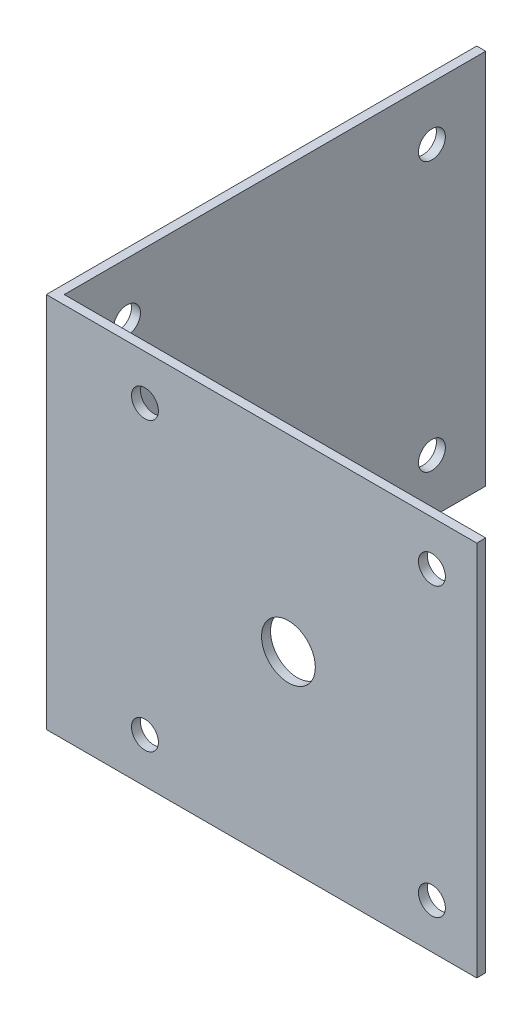
ISO-10303-21;
HEADER;
FILE_DESCRIPTION(('STEP AP214'),'2;1');
FILE_NAME('part.step','',(''),(''),'','','');
FILE_SCHEMA(('AUTOMOTIVE_DESIGN { 1 0 10303 214 1 1 1 1 }'));
ENDSEC;
DATA;
#1=APPLICATION_CONTEXT('core data for automotive mechanical design processes');
#2=APPLICATION_PROTOCOL_DEFINITION('international standard','automotive_design',2000,#1);
#3=PRODUCT_CONTEXT('',#1,'mechanical');
#4=PRODUCT('Part','Part','',(#3));
#5=PRODUCT_RELATED_PRODUCT_CATEGORY('part','',(#4));
#6=PRODUCT_DEFINITION_FORMATION('','',#4);
#7=PRODUCT_DEFINITION_CONTEXT('part definition',#1,'design');
#8=PRODUCT_DEFINITION('design','',#6,#7);
#9=PRODUCT_DEFINITION_SHAPE('','',#8);
#10=(LENGTH_UNIT() NAMED_UNIT(*) SI_UNIT(.MILLI.,.METRE.));
#11=(NAMED_UNIT(*) PLANE_ANGLE_UNIT() SI_UNIT($,.RADIAN.));
#12=(NAMED_UNIT(*) SI_UNIT($,.STERADIAN.) SOLID_ANGLE_UNIT());
#13=UNCERTAINTY_MEASURE_WITH_UNIT(LENGTH_MEASURE(1.E-05),#10,'distance_accuracy_value','');
#14=(GEOMETRIC_REPRESENTATION_CONTEXT(3) GLOBAL_UNCERTAINTY_ASSIGNED_CONTEXT((#13)) GLOBAL_UNIT_ASSIGNED_CONTEXT((#10,
#11,#12)) REPRESENTATION_CONTEXT('',''));
#15=CARTESIAN_POINT('',(0.,0.,0.));
#16=DIRECTION('',(0.,0.,1.));
#17=DIRECTION('',(1.,0.,0.));
#18=AXIS2_PLACEMENT_3D('',#15,#16,#17);
#19=CARTESIAN_POINT('',(0.,42.,0.));
#20=DIRECTION('',(0.,0.,-1.));
#21=DIRECTION('',(-1.,0.,0.));
#22=AXIS2_PLACEMENT_3D('',#19,#20,#21);
#23=PLANE('',#22);
#24=CARTESIAN_POINT('',(43.,37.,0.));
#25=DIRECTION('',(0.,0.,1.));
#26=DIRECTION('',(1.,0.,0.));
#27=AXIS2_PLACEMENT_3D('',#24,#25,#26);
#28=CIRCLE('',#27,1.5);
#29=CARTESIAN_POINT('',(44.5,37.,0.));
#30=VERTEX_POINT('',#29);
#31=EDGE_CURVE('E144',#30,#30,#28,.T.);
#32=ORIENTED_EDGE('',*,*,#31,.F.);
#33=EDGE_LOOP('',(#32));
#34=FACE_BOUND('',#33,.T.);
#35=CARTESIAN_POINT('',(43.,5.,0.));
#36=DIRECTION('',(0.,0.,1.));
#37=DIRECTION('',(1.,0.,0.));
#38=AXIS2_PLACEMENT_3D('',#35,#36,#37);
#39=CIRCLE('',#38,1.5);
#40=CARTESIAN_POINT('',(44.5,5.,0.));
#41=VERTEX_POINT('',#40);
#42=EDGE_CURVE('E196',#41,#41,#39,.T.);
#43=ORIENTED_EDGE('',*,*,#42,.F.);
#44=EDGE_LOOP('',(#43));
#45=FACE_BOUND('',#44,.T.);
#46=CARTESIAN_POINT('',(11.,5.,0.));
#47=DIRECTION('',(0.,0.,1.));
#48=DIRECTION('',(1.,0.,0.));
#49=AXIS2_PLACEMENT_3D('',#46,#47,#48);
#50=CIRCLE('',#49,1.5);
#51=CARTESIAN_POINT('',(12.5,5.,0.));
#52=VERTEX_POINT('',#51);
#53=EDGE_CURVE('E200',#52,#52,#50,.T.);
#54=ORIENTED_EDGE('',*,*,#53,.F.);
#55=EDGE_LOOP('',(#54));
#56=FACE_BOUND('',#55,.T.);
#57=CARTESIAN_POINT('',(27.,21.,0.));
#58=DIRECTION('',(0.,0.,1.));
#59=DIRECTION('',(1.,0.,0.));
#60=AXIS2_PLACEMENT_3D('',#57,#58,#59);
#61=CIRCLE('',#60,3.);
#62=CARTESIAN_POINT('',(30.,21.,0.));
#63=VERTEX_POINT('',#62);
#64=EDGE_CURVE('E159',#63,#63,#61,.T.);
#65=ORIENTED_EDGE('',*,*,#64,.F.);
#66=EDGE_LOOP('',(#65));
#67=FACE_BOUND('',#66,.T.);
#68=CARTESIAN_POINT('',(11.,37.,0.));
#69=DIRECTION('',(0.,0.,1.));
#70=DIRECTION('',(1.,0.,0.));
#71=AXIS2_PLACEMENT_3D('',#68,#69,#70);
#72=CIRCLE('',#71,1.5);
#73=CARTESIAN_POINT('',(12.5,37.,0.));
#74=VERTEX_POINT('',#73);
#75=EDGE_CURVE('E139',#74,#74,#72,.T.);
#76=ORIENTED_EDGE('',*,*,#75,.F.);
#77=EDGE_LOOP('',(#76));
#78=FACE_BOUND('',#77,.T.);
#79=DIRECTION('',(1.,0.,0.));
#80=VECTOR('',#79,1.);
#81=CARTESIAN_POINT('',(0.,0.,0.));
#82=LINE('',#81,#80);
#83=CARTESIAN_POINT('',(0.,0.,0.));
#84=VERTEX_POINT('',#83);
#85=CARTESIAN_POINT('',(48.,0.,0.));
#86=VERTEX_POINT('',#85);
#87=EDGE_CURVE('E120',#84,#86,#82,.T.);
#88=ORIENTED_EDGE('',*,*,#87,.T.);
#89=DIRECTION('',(0.,-1.,0.));
#90=VECTOR('',#89,1.);
#91=CARTESIAN_POINT('',(48.,42.,0.));
#92=LINE('',#91,#90);
#93=CARTESIAN_POINT('',(48.,42.,0.));
#94=VERTEX_POINT('',#93);
#95=EDGE_CURVE('E11',#94,#86,#92,.T.);
#96=ORIENTED_EDGE('',*,*,#95,.F.);
#97=DIRECTION('',(1.,0.,0.));
#98=VECTOR('',#97,1.);
#99=CARTESIAN_POINT('',(0.,42.,0.));
#100=LINE('',#99,#98);
#101=CARTESIAN_POINT('',(0.,42.,0.));
#102=VERTEX_POINT('',#101);
#103=EDGE_CURVE('E131',#102,#94,#100,.T.);
#104=ORIENTED_EDGE('',*,*,#103,.F.);
#105=DIRECTION('',(0.,-1.,0.));
#106=VECTOR('',#105,1.);
#107=CARTESIAN_POINT('',(0.,42.,0.));
#108=LINE('',#107,#106);
#109=EDGE_CURVE('E116',#102,#84,#108,.T.);
#110=ORIENTED_EDGE('',*,*,#109,.T.);
#111=EDGE_LOOP('',(#88,#96,#104,#110));
#112=FACE_BOUND('',#111,.T.);
#113=ADVANCED_FACE('F34',(#34,#45,#56,#67,#78,#112),#23,.F.);
#114=CARTESIAN_POINT('',(48.,42.,0.));
#115=DIRECTION('',(-1.,0.,0.));
#116=DIRECTION('',(0.,0.,1.));
#117=AXIS2_PLACEMENT_3D('',#114,#115,#116);
#118=PLANE('',#117);
#119=DIRECTION('',(0.,0.,-1.));
#120=VECTOR('',#119,1.);
#121=CARTESIAN_POINT('',(48.,0.,0.));
#122=LINE('',#121,#120);
#123=CARTESIAN_POINT('',(48.,0.,-1.));
#124=VERTEX_POINT('',#123);
#125=EDGE_CURVE('E123',#86,#124,#122,.T.);
#126=ORIENTED_EDGE('',*,*,#125,.T.);
#127=DIRECTION('',(0.,-1.,0.));
#128=VECTOR('',#127,1.);
#129=CARTESIAN_POINT('',(48.,42.,-1.));
#130=LINE('',#129,#128);
#131=CARTESIAN_POINT('',(48.,42.,-1.));
#132=VERTEX_POINT('',#131);
#133=EDGE_CURVE('E43',#132,#124,#130,.T.);
#134=ORIENTED_EDGE('',*,*,#133,.F.);
#135=DIRECTION('',(0.,0.,-1.));
#136=VECTOR('',#135,1.);
#137=CARTESIAN_POINT('',(48.,42.,0.));
#138=LINE('',#137,#136);
#139=EDGE_CURVE('E89',#94,#132,#138,.T.);
#140=ORIENTED_EDGE('',*,*,#139,.F.);
#141=ORIENTED_EDGE('',*,*,#95,.T.);
#142=EDGE_LOOP('',(#126,#134,#140,#141));
#143=FACE_BOUND('',#142,.T.);
#144=ADVANCED_FACE('F164',(#143),#118,.F.);
#145=CARTESIAN_POINT('',(1.00000000000001,42.,-1.));
#146=DIRECTION('',(0.,0.,1.));
#147=DIRECTION('',(1.,0.,0.));
#148=AXIS2_PLACEMENT_3D('',#145,#146,#147);
#149=PLANE('',#148);
#150=CARTESIAN_POINT('',(43.,37.,-1.00000000000001));
#151=DIRECTION('',(0.,0.,1.));
#152=DIRECTION('',(1.,0.,0.));
#153=AXIS2_PLACEMENT_3D('',#150,#151,#152);
#154=CIRCLE('',#153,1.5);
#155=CARTESIAN_POINT('',(44.5,37.,-1.00000000000001));
#156=VERTEX_POINT('',#155);
#157=EDGE_CURVE('E37',#156,#156,#154,.T.);
#158=ORIENTED_EDGE('',*,*,#157,.T.);
#159=EDGE_LOOP('',(#158));
#160=FACE_BOUND('',#159,.T.);
#161=CARTESIAN_POINT('',(43.,5.,-1.00000000000001));
#162=DIRECTION('',(0.,0.,1.));
#163=DIRECTION('',(1.,0.,0.));
#164=AXIS2_PLACEMENT_3D('',#161,#162,#163);
#165=CIRCLE('',#164,1.5);
#166=CARTESIAN_POINT('',(44.5,5.,-1.00000000000001));
#167=VERTEX_POINT('',#166);
#168=EDGE_CURVE('E146',#167,#167,#165,.T.);
#169=ORIENTED_EDGE('',*,*,#168,.T.);
#170=EDGE_LOOP('',(#169));
#171=FACE_BOUND('',#170,.T.);
#172=CARTESIAN_POINT('',(11.,5.,-1.00000000000001));
#173=DIRECTION('',(0.,0.,1.));
#174=DIRECTION('',(1.,0.,0.));
#175=AXIS2_PLACEMENT_3D('',#172,#173,#174);
#176=CIRCLE('',#175,1.5);
#177=CARTESIAN_POINT('',(12.5,5.,-1.00000000000001));
#178=VERTEX_POINT('',#177);
#179=EDGE_CURVE('E143',#178,#178,#176,.T.);
#180=ORIENTED_EDGE('',*,*,#179,.T.);
#181=EDGE_LOOP('',(#180));
#182=FACE_BOUND('',#181,.T.);
#183=CARTESIAN_POINT('',(27.,21.,-1.00000000000001));
#184=DIRECTION('',(0.,0.,1.));
#185=DIRECTION('',(1.,0.,0.));
#186=AXIS2_PLACEMENT_3D('',#183,#184,#185);
#187=CIRCLE('',#186,3.);
#188=CARTESIAN_POINT('',(30.,21.,-1.00000000000001));
#189=VERTEX_POINT('',#188);
#190=EDGE_CURVE('E140',#189,#189,#187,.T.);
#191=ORIENTED_EDGE('',*,*,#190,.T.);
#192=EDGE_LOOP('',(#191));
#193=FACE_BOUND('',#192,.T.);
#194=CARTESIAN_POINT('',(11.,37.,-1.00000000000001));
#195=DIRECTION('',(0.,0.,1.));
#196=DIRECTION('',(1.,0.,0.));
#197=AXIS2_PLACEMENT_3D('',#194,#195,#196);
#198=CIRCLE('',#197,1.5);
#199=CARTESIAN_POINT('',(12.5,37.,-1.00000000000001));
#200=VERTEX_POINT('',#199);
#201=EDGE_CURVE('E124',#200,#200,#198,.T.);
#202=ORIENTED_EDGE('',*,*,#201,.T.);
#203=EDGE_LOOP('',(#202));
#204=FACE_BOUND('',#203,.T.);
#205=DIRECTION('',(-1.,0.,0.));
#206=VECTOR('',#205,1.);
#207=CARTESIAN_POINT('',(1.00000000000001,0.,-1.));
#208=LINE('',#207,#206);
#209=CARTESIAN_POINT('',(1.00000000000001,0.,-1.));
#210=VERTEX_POINT('',#209);
#211=EDGE_CURVE('E126',#124,#210,#208,.T.);
#212=ORIENTED_EDGE('',*,*,#211,.T.);
#213=DIRECTION('',(0.,-1.,0.));
#214=VECTOR('',#213,1.);
#215=CARTESIAN_POINT('',(1.00000000000001,42.,-1.));
#216=LINE('',#215,#214);
#217=CARTESIAN_POINT('',(1.00000000000001,42.,-1.));
#218=VERTEX_POINT('',#217);
#219=EDGE_CURVE('E111',#218,#210,#216,.T.);
#220=ORIENTED_EDGE('',*,*,#219,.F.);
#221=DIRECTION('',(-1.,0.,0.));
#222=VECTOR('',#221,1.);
#223=CARTESIAN_POINT('',(1.00000000000001,42.,-1.));
#224=LINE('',#223,#222);
#225=EDGE_CURVE('E102',#132,#218,#224,.T.);
#226=ORIENTED_EDGE('',*,*,#225,.F.);
#227=ORIENTED_EDGE('',*,*,#133,.T.);
#228=EDGE_LOOP('',(#212,#220,#226,#227));
#229=FACE_BOUND('',#228,.T.);
#230=ADVANCED_FACE('F167',(#160,#171,#182,#193,#204,#229),#149,.F.);
#231=CARTESIAN_POINT('',(1.,42.,-48.));
#232=DIRECTION('',(-1.,0.,0.));
#233=DIRECTION('',(0.,0.,1.));
#234=AXIS2_PLACEMENT_3D('',#231,#232,#233);
#235=PLANE('',#234);
#236=CARTESIAN_POINT('',(1.00000000000001,6.,-42.));
#237=DIRECTION('',(-1.,0.,0.));
#238=DIRECTION('',(0.,0.,1.));
#239=AXIS2_PLACEMENT_3D('',#236,#237,#238);
#240=CIRCLE('',#239,1.5);
#241=CARTESIAN_POINT('',(1.00000000000001,6.,-40.5));
#242=VERTEX_POINT('',#241);
#243=EDGE_CURVE('E212',#242,#242,#240,.F.);
#244=ORIENTED_EDGE('',*,*,#243,.F.);
#245=EDGE_LOOP('',(#244));
#246=FACE_BOUND('',#245,.T.);
#247=CARTESIAN_POINT('',(1.00000000000001,5.99999999999999,-8.00000000000001));
#248=DIRECTION('',(-1.,0.,0.));
#249=DIRECTION('',(0.,0.,1.));
#250=AXIS2_PLACEMENT_3D('',#247,#248,#249);
#251=CIRCLE('',#250,1.5);
#252=CARTESIAN_POINT('',(1.00000000000001,5.99999999999999,-6.50000000000001));
#253=VERTEX_POINT('',#252);
#254=EDGE_CURVE('E332',#253,#253,#251,.F.);
#255=ORIENTED_EDGE('',*,*,#254,.F.);
#256=EDGE_LOOP('',(#255));
#257=FACE_BOUND('',#256,.T.);
#258=CARTESIAN_POINT('',(1.00000000000001,36.,-8.));
#259=DIRECTION('',(-1.,0.,0.));
#260=DIRECTION('',(0.,0.,1.));
#261=AXIS2_PLACEMENT_3D('',#258,#259,#260);
#262=CIRCLE('',#261,1.5);
#263=CARTESIAN_POINT('',(1.00000000000001,36.,-6.5));
#264=VERTEX_POINT('',#263);
#265=EDGE_CURVE('E334',#264,#264,#262,.F.);
#266=ORIENTED_EDGE('',*,*,#265,.F.);
#267=EDGE_LOOP('',(#266));
#268=FACE_BOUND('',#267,.T.);
#269=CARTESIAN_POINT('',(1.00000000000001,36.,-42.));
#270=DIRECTION('',(-1.,0.,0.));
#271=DIRECTION('',(0.,0.,1.));
#272=AXIS2_PLACEMENT_3D('',#269,#270,#271);
#273=CIRCLE('',#272,1.5);
#274=CARTESIAN_POINT('',(1.00000000000001,36.,-40.5));
#275=VERTEX_POINT('',#274);
#276=EDGE_CURVE('E205',#275,#275,#273,.F.);
#277=ORIENTED_EDGE('',*,*,#276,.F.);
#278=EDGE_LOOP('',(#277));
#279=FACE_BOUND('',#278,.T.);
#280=DIRECTION('',(0.,0.,-1.));
#281=VECTOR('',#280,1.);
#282=CARTESIAN_POINT('',(1.,0.,-48.));
#283=LINE('',#282,#281);
#284=CARTESIAN_POINT('',(1.,0.,-48.));
#285=VERTEX_POINT('',#284);
#286=EDGE_CURVE('E110',#210,#285,#283,.T.);
#287=ORIENTED_EDGE('',*,*,#286,.T.);
#288=DIRECTION('',(0.,-1.,0.));
#289=VECTOR('',#288,1.);
#290=CARTESIAN_POINT('',(1.,42.,-48.));
#291=LINE('',#290,#289);
#292=CARTESIAN_POINT('',(1.,42.,-48.));
#293=VERTEX_POINT('',#292);
#294=EDGE_CURVE('E107',#293,#285,#291,.T.);
#295=ORIENTED_EDGE('',*,*,#294,.F.);
#296=DIRECTION('',(0.,0.,-1.));
#297=VECTOR('',#296,1.);
#298=CARTESIAN_POINT('',(1.,42.,-48.));
#299=LINE('',#298,#297);
#300=EDGE_CURVE('E96',#218,#293,#299,.T.);
#301=ORIENTED_EDGE('',*,*,#300,.F.);
#302=ORIENTED_EDGE('',*,*,#219,.T.);
#303=EDGE_LOOP('',(#287,#295,#301,#302));
#304=FACE_BOUND('',#303,.T.);
#305=ADVANCED_FACE('F108',(#246,#257,#268,#279,#304),#235,.F.);
#306=CARTESIAN_POINT('',(0.,42.,-48.));
#307=DIRECTION('',(0.,0.,1.));
#308=DIRECTION('',(1.,0.,0.));
#309=AXIS2_PLACEMENT_3D('',#306,#307,#308);
#310=PLANE('',#309);
#311=DIRECTION('',(-1.,0.,0.));
#312=VECTOR('',#311,1.);
#313=CARTESIAN_POINT('',(0.,0.,-48.));
#314=LINE('',#313,#312);
#315=CARTESIAN_POINT('',(0.,0.,-48.));
#316=VERTEX_POINT('',#315);
#317=EDGE_CURVE('E75',#285,#316,#314,.T.);
#318=ORIENTED_EDGE('',*,*,#317,.T.);
#319=DIRECTION('',(0.,-1.,0.));
#320=VECTOR('',#319,1.);
#321=CARTESIAN_POINT('',(0.,42.,-48.));
#322=LINE('',#321,#320);
#323=CARTESIAN_POINT('',(0.,42.,-48.));
#324=VERTEX_POINT('',#323);
#325=EDGE_CURVE('E112',#324,#316,#322,.T.);
#326=ORIENTED_EDGE('',*,*,#325,.F.);
#327=DIRECTION('',(-1.,0.,0.));
#328=VECTOR('',#327,1.);
#329=CARTESIAN_POINT('',(0.,42.,-48.));
#330=LINE('',#329,#328);
#331=EDGE_CURVE('E100',#293,#324,#330,.T.);
#332=ORIENTED_EDGE('',*,*,#331,.F.);
#333=ORIENTED_EDGE('',*,*,#294,.T.);
#334=EDGE_LOOP('',(#318,#326,#332,#333));
#335=FACE_BOUND('',#334,.T.);
#336=ADVANCED_FACE('F114',(#335),#310,.F.);
#337=CARTESIAN_POINT('',(0.,42.,0.));
#338=DIRECTION('',(1.,0.,0.));
#339=DIRECTION('',(0.,0.,-1.));
#340=AXIS2_PLACEMENT_3D('',#337,#338,#339);
#341=PLANE('',#340);
#342=CARTESIAN_POINT('',(0.,6.,-42.));
#343=DIRECTION('',(1.,0.,0.));
#344=DIRECTION('',(0.,0.,-1.));
#345=AXIS2_PLACEMENT_3D('',#342,#343,#344);
#346=CIRCLE('',#345,1.5);
#347=CARTESIAN_POINT('',(0.,6.,-43.5));
#348=VERTEX_POINT('',#347);
#349=EDGE_CURVE('E329',#348,#348,#346,.T.);
#350=ORIENTED_EDGE('',*,*,#349,.T.);
#351=EDGE_LOOP('',(#350));
#352=FACE_BOUND('',#351,.T.);
#353=CARTESIAN_POINT('',(0.,5.99999999999999,-8.00000000000001));
#354=DIRECTION('',(1.,0.,0.));
#355=DIRECTION('',(0.,0.,-1.));
#356=AXIS2_PLACEMENT_3D('',#353,#354,#355);
#357=CIRCLE('',#356,1.5);
#358=CARTESIAN_POINT('',(0.,5.99999999999999,-9.50000000000001));
#359=VERTEX_POINT('',#358);
#360=EDGE_CURVE('E342',#359,#359,#357,.T.);
#361=ORIENTED_EDGE('',*,*,#360,.T.);
#362=EDGE_LOOP('',(#361));
#363=FACE_BOUND('',#362,.T.);
#364=CARTESIAN_POINT('',(0.,36.,-8.));
#365=DIRECTION('',(1.,0.,0.));
#366=DIRECTION('',(0.,0.,-1.));
#367=AXIS2_PLACEMENT_3D('',#364,#365,#366);
#368=CIRCLE('',#367,1.5);
#369=CARTESIAN_POINT('',(0.,36.,-9.5));
#370=VERTEX_POINT('',#369);
#371=EDGE_CURVE('E339',#370,#370,#368,.T.);
#372=ORIENTED_EDGE('',*,*,#371,.T.);
#373=EDGE_LOOP('',(#372));
#374=FACE_BOUND('',#373,.T.);
#375=CARTESIAN_POINT('',(0.,36.,-42.));
#376=DIRECTION('',(1.,0.,0.));
#377=DIRECTION('',(0.,0.,-1.));
#378=AXIS2_PLACEMENT_3D('',#375,#376,#377);
#379=CIRCLE('',#378,1.5);
#380=CARTESIAN_POINT('',(0.,36.,-43.5));
#381=VERTEX_POINT('',#380);
#382=EDGE_CURVE('E207',#381,#381,#379,.T.);
#383=ORIENTED_EDGE('',*,*,#382,.T.);
#384=EDGE_LOOP('',(#383));
#385=FACE_BOUND('',#384,.T.);
#386=DIRECTION('',(0.,0.,1.));
#387=VECTOR('',#386,1.);
#388=CARTESIAN_POINT('',(0.,0.,0.));
#389=LINE('',#388,#387);
#390=EDGE_CURVE('E81',#316,#84,#389,.T.);
#391=ORIENTED_EDGE('',*,*,#390,.T.);
#392=ORIENTED_EDGE('',*,*,#109,.F.);
#393=DIRECTION('',(0.,0.,1.));
#394=VECTOR('',#393,1.);
#395=CARTESIAN_POINT('',(0.,42.,0.));
#396=LINE('',#395,#394);
#397=EDGE_CURVE('E52',#324,#102,#396,.T.);
#398=ORIENTED_EDGE('',*,*,#397,.F.);
#399=ORIENTED_EDGE('',*,*,#325,.T.);
#400=EDGE_LOOP('',(#391,#392,#398,#399));
#401=FACE_BOUND('',#400,.T.);
#402=ADVANCED_FACE('F172',(#352,#363,#374,#385,#401),#341,.F.);
#403=CARTESIAN_POINT('',(0.,42.,0.));
#404=DIRECTION('',(0.,1.,0.));
#405=DIRECTION('',(0.,0.,1.));
#406=AXIS2_PLACEMENT_3D('',#403,#404,#405);
#407=PLANE('',#406);
#408=ORIENTED_EDGE('',*,*,#103,.T.);
#409=ORIENTED_EDGE('',*,*,#139,.T.);
#410=ORIENTED_EDGE('',*,*,#225,.T.);
#411=ORIENTED_EDGE('',*,*,#300,.T.);
#412=ORIENTED_EDGE('',*,*,#331,.T.);
#413=ORIENTED_EDGE('',*,*,#397,.T.);
#414=EDGE_LOOP('',(#408,#409,#410,#411,#412,#413));
#415=FACE_BOUND('',#414,.T.);
#416=ADVANCED_FACE('F98',(#415),#407,.T.);
#417=CARTESIAN_POINT('',(0.,0.,0.));
#418=DIRECTION('',(0.,1.,0.));
#419=DIRECTION('',(0.,0.,1.));
#420=AXIS2_PLACEMENT_3D('',#417,#418,#419);
#421=PLANE('',#420);
#422=ORIENTED_EDGE('',*,*,#87,.F.);
#423=ORIENTED_EDGE('',*,*,#390,.F.);
#424=ORIENTED_EDGE('',*,*,#317,.F.);
#425=ORIENTED_EDGE('',*,*,#286,.F.);
#426=ORIENTED_EDGE('',*,*,#211,.F.);
#427=ORIENTED_EDGE('',*,*,#125,.F.);
#428=EDGE_LOOP('',(#422,#423,#424,#425,#426,#427));
#429=FACE_BOUND('',#428,.T.);
#430=ADVANCED_FACE('F170',(#429),#421,.F.);
#431=CARTESIAN_POINT('',(11.,37.,-42.));
#432=DIRECTION('',(0.,0.,1.));
#433=DIRECTION('',(1.,0.,0.));
#434=AXIS2_PLACEMENT_3D('',#431,#432,#433);
#435=CYLINDRICAL_SURFACE('',#434,1.5);
#436=ORIENTED_EDGE('',*,*,#75,.T.);
#437=EDGE_LOOP('',(#436));
#438=FACE_BOUND('',#437,.T.);
#439=ORIENTED_EDGE('',*,*,#201,.F.);
#440=EDGE_LOOP('',(#439));
#441=FACE_BOUND('',#440,.T.);
#442=ADVANCED_FACE('F238',(#438,#441),#435,.F.);
#443=CARTESIAN_POINT('',(27.,21.,-42.));
#444=DIRECTION('',(0.,0.,1.));
#445=DIRECTION('',(1.,0.,0.));
#446=AXIS2_PLACEMENT_3D('',#443,#444,#445);
#447=CYLINDRICAL_SURFACE('',#446,3.);
#448=ORIENTED_EDGE('',*,*,#64,.T.);
#449=EDGE_LOOP('',(#448));
#450=FACE_BOUND('',#449,.T.);
#451=ORIENTED_EDGE('',*,*,#190,.F.);
#452=EDGE_LOOP('',(#451));
#453=FACE_BOUND('',#452,.T.);
#454=ADVANCED_FACE('F231',(#450,#453),#447,.F.);
#455=CARTESIAN_POINT('',(11.,5.,-42.));
#456=DIRECTION('',(0.,0.,1.));
#457=DIRECTION('',(1.,0.,0.));
#458=AXIS2_PLACEMENT_3D('',#455,#456,#457);
#459=CYLINDRICAL_SURFACE('',#458,1.5);
#460=ORIENTED_EDGE('',*,*,#53,.T.);
#461=EDGE_LOOP('',(#460));
#462=FACE_BOUND('',#461,.T.);
#463=ORIENTED_EDGE('',*,*,#179,.F.);
#464=EDGE_LOOP('',(#463));
#465=FACE_BOUND('',#464,.T.);
#466=ADVANCED_FACE('F222',(#462,#465),#459,.F.);
#467=CARTESIAN_POINT('',(43.,5.,-42.));
#468=DIRECTION('',(0.,0.,1.));
#469=DIRECTION('',(1.,0.,0.));
#470=AXIS2_PLACEMENT_3D('',#467,#468,#469);
#471=CYLINDRICAL_SURFACE('',#470,1.5);
#472=ORIENTED_EDGE('',*,*,#42,.T.);
#473=EDGE_LOOP('',(#472));
#474=FACE_BOUND('',#473,.T.);
#475=ORIENTED_EDGE('',*,*,#168,.F.);
#476=EDGE_LOOP('',(#475));
#477=FACE_BOUND('',#476,.T.);
#478=ADVANCED_FACE('F218',(#474,#477),#471,.F.);
#479=CARTESIAN_POINT('',(43.,37.,-42.));
#480=DIRECTION('',(0.,0.,1.));
#481=DIRECTION('',(1.,0.,0.));
#482=AXIS2_PLACEMENT_3D('',#479,#480,#481);
#483=CYLINDRICAL_SURFACE('',#482,1.5);
#484=ORIENTED_EDGE('',*,*,#31,.T.);
#485=EDGE_LOOP('',(#484));
#486=FACE_BOUND('',#485,.T.);
#487=ORIENTED_EDGE('',*,*,#157,.F.);
#488=EDGE_LOOP('',(#487));
#489=FACE_BOUND('',#488,.T.);
#490=ADVANCED_FACE('F221',(#486,#489),#483,.F.);
#491=CARTESIAN_POINT('',(42.,36.,-42.));
#492=DIRECTION('',(-1.,0.,0.));
#493=DIRECTION('',(0.,0.,1.));
#494=AXIS2_PLACEMENT_3D('',#491,#492,#493);
#495=CYLINDRICAL_SURFACE('',#494,1.5);
#496=ORIENTED_EDGE('',*,*,#382,.F.);
#497=EDGE_LOOP('',(#496));
#498=FACE_BOUND('',#497,.T.);
#499=ORIENTED_EDGE('',*,*,#276,.T.);
#500=EDGE_LOOP('',(#499));
#501=FACE_BOUND('',#500,.T.);
#502=ADVANCED_FACE('F228',(#498,#501),#495,.F.);
#503=CARTESIAN_POINT('',(42.,36.,-8.));
#504=DIRECTION('',(-1.,0.,0.));
#505=DIRECTION('',(0.,0.,1.));
#506=AXIS2_PLACEMENT_3D('',#503,#504,#505);
#507=CYLINDRICAL_SURFACE('',#506,1.5);
#508=ORIENTED_EDGE('',*,*,#371,.F.);
#509=EDGE_LOOP('',(#508));
#510=FACE_BOUND('',#509,.T.);
#511=ORIENTED_EDGE('',*,*,#265,.T.);
#512=EDGE_LOOP('',(#511));
#513=FACE_BOUND('',#512,.T.);
#514=ADVANCED_FACE('F294',(#510,#513),#507,.F.);
#515=CARTESIAN_POINT('',(42.,5.99999999999999,-8.00000000000001));
#516=DIRECTION('',(-1.,0.,0.));
#517=DIRECTION('',(0.,0.,1.));
#518=AXIS2_PLACEMENT_3D('',#515,#516,#517);
#519=CYLINDRICAL_SURFACE('',#518,1.5);
#520=ORIENTED_EDGE('',*,*,#360,.F.);
#521=EDGE_LOOP('',(#520));
#522=FACE_BOUND('',#521,.T.);
#523=ORIENTED_EDGE('',*,*,#254,.T.);
#524=EDGE_LOOP('',(#523));
#525=FACE_BOUND('',#524,.T.);
#526=ADVANCED_FACE('F303',(#522,#525),#519,.F.);
#527=CARTESIAN_POINT('',(42.,6.,-42.));
#528=DIRECTION('',(-1.,0.,0.));
#529=DIRECTION('',(0.,0.,1.));
#530=AXIS2_PLACEMENT_3D('',#527,#528,#529);
#531=CYLINDRICAL_SURFACE('',#530,1.5);
#532=ORIENTED_EDGE('',*,*,#349,.F.);
#533=EDGE_LOOP('',(#532));
#534=FACE_BOUND('',#533,.T.);
#535=ORIENTED_EDGE('',*,*,#243,.T.);
#536=EDGE_LOOP('',(#535));
#537=FACE_BOUND('',#536,.T.);
#538=ADVANCED_FACE('F313',(#534,#537),#531,.F.);
#539=CLOSED_SHELL('',(#113,#144,#230,#305,#336,#402,#416,#430,#442,#454,#466,#478,#490,#502,
#514,#526,#538));
#540=MANIFOLD_SOLID_BREP('B2',#539);
#541=ADVANCED_BREP_SHAPE_REPRESENTATION('',(#18,#540),#14);
#542=SHAPE_DEFINITION_REPRESENTATION(#9,#541);
ENDSEC;
END-ISO-10303-21;
